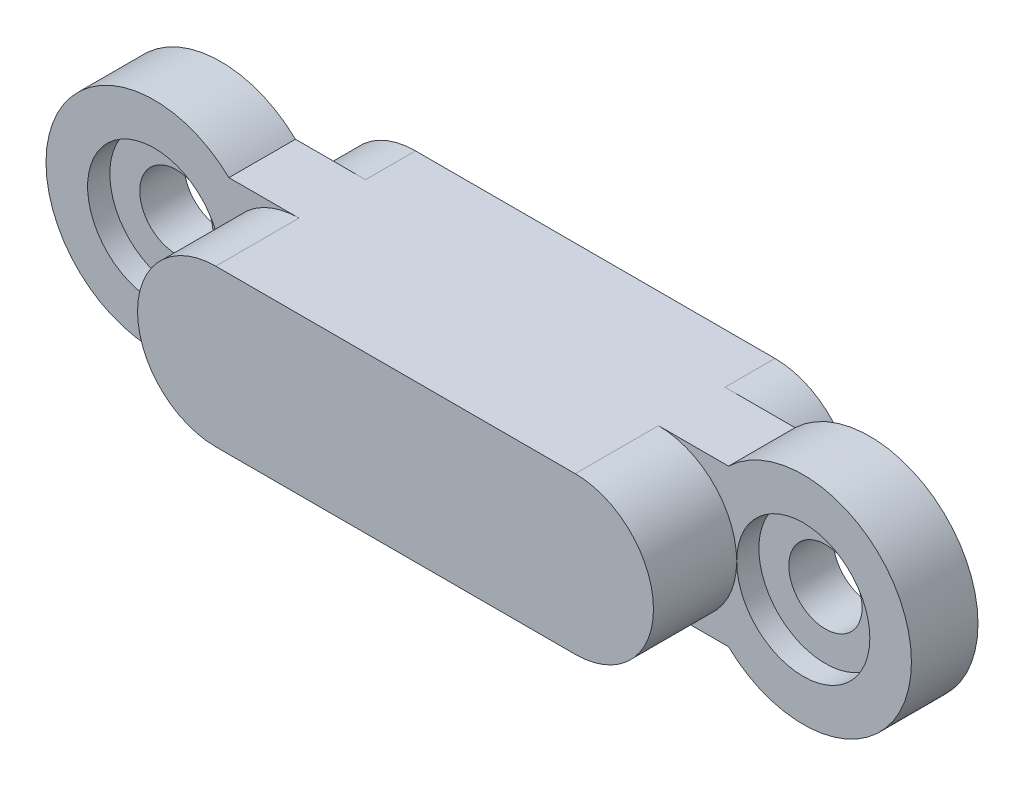
ISO-10303-21;
HEADER;
FILE_DESCRIPTION(('STEP AP214'),'2;1');
FILE_NAME('part.step','',(''),(''),'','','');
FILE_SCHEMA(('AUTOMOTIVE_DESIGN { 1 0 10303 214 1 1 1 1 }'));
ENDSEC;
DATA;
#1=APPLICATION_CONTEXT('core data for automotive mechanical design processes');
#2=APPLICATION_PROTOCOL_DEFINITION('international standard','automotive_design',2000,#1);
#3=PRODUCT_CONTEXT('',#1,'mechanical');
#4=PRODUCT('Part','Part','',(#3));
#5=PRODUCT_RELATED_PRODUCT_CATEGORY('part','',(#4));
#6=PRODUCT_DEFINITION_FORMATION('','',#4);
#7=PRODUCT_DEFINITION_CONTEXT('part definition',#1,'design');
#8=PRODUCT_DEFINITION('design','',#6,#7);
#9=PRODUCT_DEFINITION_SHAPE('','',#8);
#10=(LENGTH_UNIT() NAMED_UNIT(*) SI_UNIT(.MILLI.,.METRE.));
#11=(NAMED_UNIT(*) PLANE_ANGLE_UNIT() SI_UNIT($,.RADIAN.));
#12=(NAMED_UNIT(*) SI_UNIT($,.STERADIAN.) SOLID_ANGLE_UNIT());
#13=UNCERTAINTY_MEASURE_WITH_UNIT(LENGTH_MEASURE(1.E-05),#10,'distance_accuracy_value','');
#14=(GEOMETRIC_REPRESENTATION_CONTEXT(3) GLOBAL_UNCERTAINTY_ASSIGNED_CONTEXT((#13)) GLOBAL_UNIT_ASSIGNED_CONTEXT((#10,
#11,#12)) REPRESENTATION_CONTEXT('',''));
#15=CARTESIAN_POINT('',(0.,0.,0.));
#16=DIRECTION('',(0.,0.,1.));
#17=DIRECTION('',(1.,0.,0.));
#18=AXIS2_PLACEMENT_3D('',#15,#16,#17);
#19=CARTESIAN_POINT('',(0.,0.,-0.1));
#20=DIRECTION('',(0.,0.,-1.));
#21=DIRECTION('',(-1.,0.,0.));
#22=AXIS2_PLACEMENT_3D('',#19,#20,#21);
#23=PLANE('',#22);
#24=CARTESIAN_POINT('',(10.8,-2.35,-0.1));
#25=DIRECTION('',(0.,0.,-1.));
#26=DIRECTION('',(-1.,0.,0.));
#27=AXIS2_PLACEMENT_3D('',#24,#25,#26);
#28=CIRCLE('',#27,2.35);
#29=CARTESIAN_POINT('',(10.8,0.,-0.1));
#30=VERTEX_POINT('',#29);
#31=CARTESIAN_POINT('',(10.8,-4.7,-0.1));
#32=VERTEX_POINT('',#31);
#33=EDGE_CURVE('E86',#30,#32,#28,.T.);
#34=ORIENTED_EDGE('',*,*,#33,.F.);
#35=DIRECTION('',(-1.,0.,0.));
#36=VECTOR('',#35,1.);
#37=CARTESIAN_POINT('',(0.,0.,-0.1));
#38=LINE('',#37,#36);
#39=CARTESIAN_POINT('',(12.9050055679356,0.,-0.1));
#40=VERTEX_POINT('',#39);
#41=EDGE_CURVE('E222',#40,#30,#38,.T.);
#42=ORIENTED_EDGE('',*,*,#41,.F.);
#43=CARTESIAN_POINT('',(15.15,-2.35,-0.1));
#44=DIRECTION('',(0.,0.,-1.));
#45=DIRECTION('',(-1.,0.,0.));
#46=AXIS2_PLACEMENT_3D('',#43,#44,#45);
#47=CIRCLE('',#46,3.25);
#48=CARTESIAN_POINT('',(12.9050055679356,-4.7,-0.1));
#49=VERTEX_POINT('',#48);
#50=EDGE_CURVE('E224',#40,#49,#47,.T.);
#51=ORIENTED_EDGE('',*,*,#50,.T.);
#52=DIRECTION('',(-1.,0.,0.));
#53=VECTOR('',#52,1.);
#54=CARTESIAN_POINT('',(0.,-4.7,-0.1));
#55=LINE('',#54,#53);
#56=EDGE_CURVE('E215',#49,#32,#55,.T.);
#57=ORIENTED_EDGE('',*,*,#56,.T.);
#58=EDGE_LOOP('',(#34,#42,#51,#57));
#59=FACE_BOUND('',#58,.T.);
#60=CARTESIAN_POINT('',(15.15,-2.35,-0.1));
#61=DIRECTION('',(0.,0.,-1.));
#62=DIRECTION('',(-1.,0.,0.));
#63=AXIS2_PLACEMENT_3D('',#60,#61,#62);
#64=CIRCLE('',#63,1.1);
#65=CARTESIAN_POINT('',(14.05,-2.35,-0.1));
#66=VERTEX_POINT('',#65);
#67=EDGE_CURVE('E229',#66,#66,#64,.T.);
#68=ORIENTED_EDGE('',*,*,#67,.F.);
#69=EDGE_LOOP('',(#68));
#70=FACE_BOUND('',#69,.T.);
#71=ADVANCED_FACE('F71',(#59,#70),#23,.T.);
#72=CARTESIAN_POINT('',(-4.35,-2.34999999999999,-0.1));
#73=DIRECTION('',(0.,0.,1.));
#74=DIRECTION('',(1.,0.,0.));
#75=AXIS2_PLACEMENT_3D('',#72,#73,#74);
#76=CYLINDRICAL_SURFACE('',#75,1.1);
#77=CARTESIAN_POINT('',(-4.35,-2.34999999999999,-0.1));
#78=DIRECTION('',(0.,0.,-1.));
#79=DIRECTION('',(-1.,0.,0.));
#80=AXIS2_PLACEMENT_3D('',#77,#78,#79);
#81=CIRCLE('',#80,1.1);
#82=CARTESIAN_POINT('',(-5.45,-2.34999999999999,-0.1));
#83=VERTEX_POINT('',#82);
#84=EDGE_CURVE('E226',#83,#83,#81,.T.);
#85=ORIENTED_EDGE('',*,*,#84,.T.);
#86=EDGE_LOOP('',(#85));
#87=FACE_BOUND('',#86,.T.);
#88=CARTESIAN_POINT('',(-4.35,-2.34999999999999,1.23333333333333));
#89=DIRECTION('',(0.,0.,1.));
#90=DIRECTION('',(1.,0.,0.));
#91=AXIS2_PLACEMENT_3D('',#88,#89,#90);
#92=CIRCLE('',#91,1.1);
#93=CARTESIAN_POINT('',(-3.25,-2.34999999999999,1.23333333333333));
#94=VERTEX_POINT('',#93);
#95=EDGE_CURVE('E285',#94,#94,#92,.T.);
#96=ORIENTED_EDGE('',*,*,#95,.T.);
#97=EDGE_LOOP('',(#96));
#98=FACE_BOUND('',#97,.T.);
#99=ADVANCED_FACE('F321',(#87,#98),#76,.F.);
#100=CARTESIAN_POINT('',(15.15,-2.35,-0.1));
#101=DIRECTION('',(0.,0.,1.));
#102=DIRECTION('',(1.,0.,0.));
#103=AXIS2_PLACEMENT_3D('',#100,#101,#102);
#104=CYLINDRICAL_SURFACE('',#103,1.1);
#105=ORIENTED_EDGE('',*,*,#67,.T.);
#106=EDGE_LOOP('',(#105));
#107=FACE_BOUND('',#106,.T.);
#108=CARTESIAN_POINT('',(15.15,-2.35,1.23333333333333));
#109=DIRECTION('',(0.,0.,1.));
#110=DIRECTION('',(1.,0.,0.));
#111=AXIS2_PLACEMENT_3D('',#108,#109,#110);
#112=CIRCLE('',#111,1.1);
#113=CARTESIAN_POINT('',(16.25,-2.35,1.23333333333333));
#114=VERTEX_POINT('',#113);
#115=EDGE_CURVE('E208',#114,#114,#112,.T.);
#116=ORIENTED_EDGE('',*,*,#115,.T.);
#117=EDGE_LOOP('',(#116));
#118=FACE_BOUND('',#117,.T.);
#119=ADVANCED_FACE('F326',(#107,#118),#104,.F.);
#120=CARTESIAN_POINT('',(0.,-2.35,4.4));
#121=DIRECTION('',(0.,0.,-1.));
#122=DIRECTION('',(-1.,0.,0.));
#123=AXIS2_PLACEMENT_3D('',#120,#121,#122);
#124=CYLINDRICAL_SURFACE('',#123,2.35);
#125=CARTESIAN_POINT('',(0.,-2.35,1.9));
#126=DIRECTION('',(0.,0.,1.));
#127=DIRECTION('',(1.,0.,0.));
#128=AXIS2_PLACEMENT_3D('',#125,#126,#127);
#129=CIRCLE('',#128,2.35);
#130=CARTESIAN_POINT('',(0.,0.,1.9));
#131=VERTEX_POINT('',#130);
#132=CARTESIAN_POINT('',(-2.35,-2.35,1.9));
#133=VERTEX_POINT('',#132);
#134=EDGE_CURVE('E269',#131,#133,#129,.T.);
#135=ORIENTED_EDGE('',*,*,#134,.T.);
#136=CARTESIAN_POINT('',(0.,-4.7,1.9));
#137=VERTEX_POINT('',#136);
#138=EDGE_CURVE('E256',#133,#137,#129,.T.);
#139=ORIENTED_EDGE('',*,*,#138,.T.);
#140=DIRECTION('',(0.,0.,-1.));
#141=VECTOR('',#140,1.);
#142=CARTESIAN_POINT('',(0.,-4.7,4.4));
#143=LINE('',#142,#141);
#144=CARTESIAN_POINT('',(0.,-4.7,4.4));
#145=VERTEX_POINT('',#144);
#146=EDGE_CURVE('E79',#145,#137,#143,.T.);
#147=ORIENTED_EDGE('',*,*,#146,.F.);
#148=CARTESIAN_POINT('',(0.,-2.35,4.4));
#149=DIRECTION('',(0.,0.,1.));
#150=DIRECTION('',(1.,0.,0.));
#151=AXIS2_PLACEMENT_3D('',#148,#149,#150);
#152=CIRCLE('',#151,2.35);
#153=CARTESIAN_POINT('',(0.,0.,4.4));
#154=VERTEX_POINT('',#153);
#155=EDGE_CURVE('E257',#154,#145,#152,.T.);
#156=ORIENTED_EDGE('',*,*,#155,.F.);
#157=DIRECTION('',(0.,0.,-1.));
#158=VECTOR('',#157,1.);
#159=CARTESIAN_POINT('',(0.,0.,4.4));
#160=LINE('',#159,#158);
#161=EDGE_CURVE('E268',#154,#131,#160,.T.);
#162=ORIENTED_EDGE('',*,*,#161,.T.);
#163=EDGE_LOOP('',(#135,#139,#147,#156,#162));
#164=FACE_BOUND('',#163,.T.);
#165=ADVANCED_FACE('F73',(#164),#124,.T.);
#166=CARTESIAN_POINT('',(0.,-4.7,4.4));
#167=DIRECTION('',(0.,1.,0.));
#168=DIRECTION('',(0.,0.,1.));
#169=AXIS2_PLACEMENT_3D('',#166,#167,#168);
#170=PLANE('',#169);
#171=ORIENTED_EDGE('',*,*,#146,.T.);
#172=DIRECTION('',(-1.,0.,0.));
#173=VECTOR('',#172,1.);
#174=CARTESIAN_POINT('',(0.,-4.7,1.9));
#175=LINE('',#174,#173);
#176=CARTESIAN_POINT('',(-2.10500556793564,-4.7,1.9));
#177=VERTEX_POINT('',#176);
#178=EDGE_CURVE('E237',#137,#177,#175,.T.);
#179=ORIENTED_EDGE('',*,*,#178,.T.);
#180=DIRECTION('',(0.,0.,1.));
#181=VECTOR('',#180,1.);
#182=CARTESIAN_POINT('',(-2.10500556793564,-4.7,-0.1));
#183=LINE('',#182,#181);
#184=CARTESIAN_POINT('',(-2.10500556793564,-4.7,-0.1));
#185=VERTEX_POINT('',#184);
#186=EDGE_CURVE('E253',#185,#177,#183,.T.);
#187=ORIENTED_EDGE('',*,*,#186,.F.);
#188=CARTESIAN_POINT('',(0.,-4.7,-0.1));
#189=VERTEX_POINT('',#188);
#190=EDGE_CURVE('E218',#189,#185,#55,.T.);
#191=ORIENTED_EDGE('',*,*,#190,.F.);
#192=DIRECTION('',(0.,0.,1.));
#193=VECTOR('',#192,1.);
#194=CARTESIAN_POINT('',(0.,-4.7,-1.6));
#195=LINE('',#194,#193);
#196=CARTESIAN_POINT('',(0.,-4.7,-1.6));
#197=VERTEX_POINT('',#196);
#198=EDGE_CURVE('E192',#197,#189,#195,.T.);
#199=ORIENTED_EDGE('',*,*,#198,.F.);
#200=DIRECTION('',(-1.,0.,0.));
#201=VECTOR('',#200,1.);
#202=CARTESIAN_POINT('',(10.8,-4.7,-1.6));
#203=LINE('',#202,#201);
#204=CARTESIAN_POINT('',(10.8,-4.7,-1.6));
#205=VERTEX_POINT('',#204);
#206=EDGE_CURVE('E184',#205,#197,#203,.T.);
#207=ORIENTED_EDGE('',*,*,#206,.F.);
#208=DIRECTION('',(0.,0.,1.));
#209=VECTOR('',#208,1.);
#210=CARTESIAN_POINT('',(10.8,-4.7,-1.6));
#211=LINE('',#210,#209);
#212=EDGE_CURVE('E199',#205,#32,#211,.T.);
#213=ORIENTED_EDGE('',*,*,#212,.T.);
#214=ORIENTED_EDGE('',*,*,#56,.F.);
#215=DIRECTION('',(0.,0.,1.));
#216=VECTOR('',#215,1.);
#217=CARTESIAN_POINT('',(12.9050055679356,-4.7,-0.1));
#218=LINE('',#217,#216);
#219=CARTESIAN_POINT('',(12.9050055679356,-4.7,1.9));
#220=VERTEX_POINT('',#219);
#221=EDGE_CURVE('E232',#49,#220,#218,.T.);
#222=ORIENTED_EDGE('',*,*,#221,.T.);
#223=CARTESIAN_POINT('',(10.8,-4.7,1.9));
#224=VERTEX_POINT('',#223);
#225=EDGE_CURVE('E233',#220,#224,#175,.T.);
#226=ORIENTED_EDGE('',*,*,#225,.T.);
#227=DIRECTION('',(0.,0.,-1.));
#228=VECTOR('',#227,1.);
#229=CARTESIAN_POINT('',(10.8,-4.7,4.4));
#230=LINE('',#229,#228);
#231=CARTESIAN_POINT('',(10.8,-4.7,4.4));
#232=VERTEX_POINT('',#231);
#233=EDGE_CURVE('E279',#232,#224,#230,.T.);
#234=ORIENTED_EDGE('',*,*,#233,.F.);
#235=DIRECTION('',(1.,0.,0.));
#236=VECTOR('',#235,1.);
#237=CARTESIAN_POINT('',(0.,-4.7,4.4));
#238=LINE('',#237,#236);
#239=EDGE_CURVE('E260',#145,#232,#238,.T.);
#240=ORIENTED_EDGE('',*,*,#239,.F.);
#241=EDGE_LOOP('',(#171,#179,#187,#191,#199,#207,#213,#214,#222,#226,#234,#240));
#242=FACE_BOUND('',#241,.T.);
#243=ADVANCED_FACE('F293',(#242),#170,.F.);
#244=CARTESIAN_POINT('',(10.8,-2.35,4.4));
#245=DIRECTION('',(0.,0.,-1.));
#246=DIRECTION('',(-1.,0.,0.));
#247=AXIS2_PLACEMENT_3D('',#244,#245,#246);
#248=CYLINDRICAL_SURFACE('',#247,2.35);
#249=CARTESIAN_POINT('',(10.8,-2.35,1.9));
#250=DIRECTION('',(0.,0.,1.));
#251=DIRECTION('',(1.,0.,0.));
#252=AXIS2_PLACEMENT_3D('',#249,#250,#251);
#253=CIRCLE('',#252,2.35);
#254=CARTESIAN_POINT('',(13.15,-2.35,1.9));
#255=VERTEX_POINT('',#254);
#256=EDGE_CURVE('E261',#224,#255,#253,.T.);
#257=ORIENTED_EDGE('',*,*,#256,.T.);
#258=CARTESIAN_POINT('',(10.8,0.,1.9));
#259=VERTEX_POINT('',#258);
#260=EDGE_CURVE('E272',#255,#259,#253,.T.);
#261=ORIENTED_EDGE('',*,*,#260,.T.);
#262=DIRECTION('',(0.,0.,-1.));
#263=VECTOR('',#262,1.);
#264=CARTESIAN_POINT('',(10.8,0.,4.4));
#265=LINE('',#264,#263);
#266=CARTESIAN_POINT('',(10.8,0.,4.4));
#267=VERTEX_POINT('',#266);
#268=EDGE_CURVE('E277',#267,#259,#265,.T.);
#269=ORIENTED_EDGE('',*,*,#268,.F.);
#270=CARTESIAN_POINT('',(10.8,-2.35,4.4));
#271=DIRECTION('',(0.,0.,1.));
#272=DIRECTION('',(1.,0.,0.));
#273=AXIS2_PLACEMENT_3D('',#270,#271,#272);
#274=CIRCLE('',#273,2.35);
#275=EDGE_CURVE('E263',#232,#267,#274,.T.);
#276=ORIENTED_EDGE('',*,*,#275,.F.);
#277=ORIENTED_EDGE('',*,*,#233,.T.);
#278=EDGE_LOOP('',(#257,#261,#269,#276,#277));
#279=FACE_BOUND('',#278,.T.);
#280=ADVANCED_FACE('F355',(#279),#248,.T.);
#281=CARTESIAN_POINT('',(0.,0.,4.4));
#282=DIRECTION('',(0.,1.,0.));
#283=DIRECTION('',(0.,0.,1.));
#284=AXIS2_PLACEMENT_3D('',#281,#282,#283);
#285=PLANE('',#284);
#286=ORIENTED_EDGE('',*,*,#268,.T.);
#287=DIRECTION('',(-1.,0.,0.));
#288=VECTOR('',#287,1.);
#289=CARTESIAN_POINT('',(0.,0.,1.9));
#290=LINE('',#289,#288);
#291=CARTESIAN_POINT('',(12.9050055679356,0.,1.9));
#292=VERTEX_POINT('',#291);
#293=EDGE_CURVE('E241',#292,#259,#290,.T.);
#294=ORIENTED_EDGE('',*,*,#293,.F.);
#295=DIRECTION('',(0.,0.,1.));
#296=VECTOR('',#295,1.);
#297=CARTESIAN_POINT('',(12.9050055679356,0.,-0.1));
#298=LINE('',#297,#296);
#299=EDGE_CURVE('E248',#40,#292,#298,.T.);
#300=ORIENTED_EDGE('',*,*,#299,.F.);
#301=ORIENTED_EDGE('',*,*,#41,.T.);
#302=DIRECTION('',(0.,0.,1.));
#303=VECTOR('',#302,1.);
#304=CARTESIAN_POINT('',(10.8,0.,-1.6));
#305=LINE('',#304,#303);
#306=CARTESIAN_POINT('',(10.8,0.,-1.6));
#307=VERTEX_POINT('',#306);
#308=EDGE_CURVE('E176',#307,#30,#305,.T.);
#309=ORIENTED_EDGE('',*,*,#308,.F.);
#310=DIRECTION('',(-1.,0.,0.));
#311=VECTOR('',#310,1.);
#312=CARTESIAN_POINT('',(10.8,0.,-1.6));
#313=LINE('',#312,#311);
#314=CARTESIAN_POINT('',(0.,0.,-1.6));
#315=VERTEX_POINT('',#314);
#316=EDGE_CURVE('E182',#307,#315,#313,.T.);
#317=ORIENTED_EDGE('',*,*,#316,.T.);
#318=DIRECTION('',(0.,0.,1.));
#319=VECTOR('',#318,1.);
#320=CARTESIAN_POINT('',(0.,0.,-1.6));
#321=LINE('',#320,#319);
#322=CARTESIAN_POINT('',(0.,0.,-0.1));
#323=VERTEX_POINT('',#322);
#324=EDGE_CURVE('E167',#315,#323,#321,.T.);
#325=ORIENTED_EDGE('',*,*,#324,.T.);
#326=CARTESIAN_POINT('',(-2.10500556793563,0.,-0.1));
#327=VERTEX_POINT('',#326);
#328=EDGE_CURVE('E221',#323,#327,#38,.T.);
#329=ORIENTED_EDGE('',*,*,#328,.T.);
#330=DIRECTION('',(0.,0.,1.));
#331=VECTOR('',#330,1.);
#332=CARTESIAN_POINT('',(-2.10500556793563,0.,-0.1));
#333=LINE('',#332,#331);
#334=CARTESIAN_POINT('',(-2.10500556793563,0.,1.9));
#335=VERTEX_POINT('',#334);
#336=EDGE_CURVE('E250',#327,#335,#333,.T.);
#337=ORIENTED_EDGE('',*,*,#336,.T.);
#338=EDGE_CURVE('E240',#131,#335,#290,.T.);
#339=ORIENTED_EDGE('',*,*,#338,.F.);
#340=ORIENTED_EDGE('',*,*,#161,.F.);
#341=DIRECTION('',(1.,0.,0.));
#342=VECTOR('',#341,1.);
#343=CARTESIAN_POINT('',(0.,0.,4.4));
#344=LINE('',#343,#342);
#345=EDGE_CURVE('E265',#154,#267,#344,.T.);
#346=ORIENTED_EDGE('',*,*,#345,.T.);
#347=EDGE_LOOP('',(#286,#294,#300,#301,#309,#317,#325,#329,#337,#339,#340,#346));
#348=FACE_BOUND('',#347,.T.);
#349=ADVANCED_FACE('F187',(#348),#285,.T.);
#350=CARTESIAN_POINT('',(0.,0.,4.4));
#351=DIRECTION('',(0.,0.,1.));
#352=DIRECTION('',(1.,0.,0.));
#353=AXIS2_PLACEMENT_3D('',#350,#351,#352);
#354=PLANE('',#353);
#355=ORIENTED_EDGE('',*,*,#155,.T.);
#356=ORIENTED_EDGE('',*,*,#239,.T.);
#357=ORIENTED_EDGE('',*,*,#275,.T.);
#358=ORIENTED_EDGE('',*,*,#345,.F.);
#359=EDGE_LOOP('',(#355,#356,#357,#358));
#360=FACE_BOUND('',#359,.T.);
#361=ADVANCED_FACE('F349',(#360),#354,.T.);
#362=CARTESIAN_POINT('',(0.,0.,1.9));
#363=DIRECTION('',(0.,0.,-1.));
#364=DIRECTION('',(-1.,0.,0.));
#365=AXIS2_PLACEMENT_3D('',#362,#363,#364);
#366=PLANE('',#365);
#367=ORIENTED_EDGE('',*,*,#138,.F.);
#368=CARTESIAN_POINT('',(-4.35,-2.34999999999999,1.9));
#369=DIRECTION('',(0.,0.,1.));
#370=DIRECTION('',(1.,0.,0.));
#371=AXIS2_PLACEMENT_3D('',#368,#369,#370);
#372=CIRCLE('',#371,2.);
#373=EDGE_CURVE('E211',#133,#133,#372,.T.);
#374=ORIENTED_EDGE('',*,*,#373,.F.);
#375=ORIENTED_EDGE('',*,*,#134,.F.);
#376=ORIENTED_EDGE('',*,*,#338,.T.);
#377=CARTESIAN_POINT('',(-4.35,-2.34999999999999,1.9));
#378=DIRECTION('',(0.,0.,-1.));
#379=DIRECTION('',(-1.,0.,0.));
#380=AXIS2_PLACEMENT_3D('',#377,#378,#379);
#381=CIRCLE('',#380,3.25);
#382=EDGE_CURVE('E236',#177,#335,#381,.T.);
#383=ORIENTED_EDGE('',*,*,#382,.F.);
#384=ORIENTED_EDGE('',*,*,#178,.F.);
#385=EDGE_LOOP('',(#367,#374,#375,#376,#383,#384));
#386=FACE_BOUND('',#385,.T.);
#387=ADVANCED_FACE('F297',(#386),#366,.F.);
#388=CARTESIAN_POINT('',(-4.35,-2.34999999999999,-0.1));
#389=DIRECTION('',(0.,0.,1.));
#390=DIRECTION('',(1.,0.,0.));
#391=AXIS2_PLACEMENT_3D('',#388,#389,#390);
#392=CYLINDRICAL_SURFACE('',#391,3.25);
#393=ORIENTED_EDGE('',*,*,#382,.T.);
#394=ORIENTED_EDGE('',*,*,#336,.F.);
#395=CARTESIAN_POINT('',(-4.35,-2.34999999999999,-0.1));
#396=DIRECTION('',(0.,0.,-1.));
#397=DIRECTION('',(-1.,0.,0.));
#398=AXIS2_PLACEMENT_3D('',#395,#396,#397);
#399=CIRCLE('',#398,3.25);
#400=EDGE_CURVE('E217',#185,#327,#399,.T.);
#401=ORIENTED_EDGE('',*,*,#400,.F.);
#402=ORIENTED_EDGE('',*,*,#186,.T.);
#403=EDGE_LOOP('',(#393,#394,#401,#402));
#404=FACE_BOUND('',#403,.T.);
#405=ADVANCED_FACE('F302',(#404),#392,.T.);
#406=CARTESIAN_POINT('',(15.15,-2.35,-0.1));
#407=DIRECTION('',(0.,0.,1.));
#408=DIRECTION('',(1.,0.,0.));
#409=AXIS2_PLACEMENT_3D('',#406,#407,#408);
#410=CYLINDRICAL_SURFACE('',#409,3.25);
#411=CARTESIAN_POINT('',(15.15,-2.35,1.9));
#412=DIRECTION('',(0.,0.,-1.));
#413=DIRECTION('',(-1.,0.,0.));
#414=AXIS2_PLACEMENT_3D('',#411,#412,#413);
#415=CIRCLE('',#414,3.25);
#416=EDGE_CURVE('E244',#292,#220,#415,.T.);
#417=ORIENTED_EDGE('',*,*,#416,.T.);
#418=ORIENTED_EDGE('',*,*,#221,.F.);
#419=ORIENTED_EDGE('',*,*,#50,.F.);
#420=ORIENTED_EDGE('',*,*,#299,.T.);
#421=EDGE_LOOP('',(#417,#418,#419,#420));
#422=FACE_BOUND('',#421,.T.);
#423=ADVANCED_FACE('F334',(#422),#410,.T.);
#424=CARTESIAN_POINT('',(0.,-2.35,-0.1));
#425=DIRECTION('',(0.,0.,-1.));
#426=DIRECTION('',(-1.,0.,0.));
#427=AXIS2_PLACEMENT_3D('',#424,#425,#426);
#428=CIRCLE('',#427,2.35);
#429=EDGE_CURVE('E94',#189,#323,#428,.T.);
#430=ORIENTED_EDGE('',*,*,#429,.F.);
#431=ORIENTED_EDGE('',*,*,#190,.T.);
#432=ORIENTED_EDGE('',*,*,#400,.T.);
#433=ORIENTED_EDGE('',*,*,#328,.F.);
#434=EDGE_LOOP('',(#430,#431,#432,#433));
#435=FACE_BOUND('',#434,.T.);
#436=ORIENTED_EDGE('',*,*,#84,.F.);
#437=EDGE_LOOP('',(#436));
#438=FACE_BOUND('',#437,.T.);
#439=ADVANCED_FACE('F303',(#435,#438),#23,.T.);
#440=ORIENTED_EDGE('',*,*,#260,.F.);
#441=CARTESIAN_POINT('',(15.15,-2.35,1.9));
#442=DIRECTION('',(0.,0.,1.));
#443=DIRECTION('',(1.,0.,0.));
#444=AXIS2_PLACEMENT_3D('',#441,#442,#443);
#445=CIRCLE('',#444,2.);
#446=EDGE_CURVE('E209',#255,#255,#445,.T.);
#447=ORIENTED_EDGE('',*,*,#446,.F.);
#448=ORIENTED_EDGE('',*,*,#256,.F.);
#449=ORIENTED_EDGE('',*,*,#225,.F.);
#450=ORIENTED_EDGE('',*,*,#416,.F.);
#451=ORIENTED_EDGE('',*,*,#293,.T.);
#452=EDGE_LOOP('',(#440,#447,#448,#449,#450,#451));
#453=FACE_BOUND('',#452,.T.);
#454=ADVANCED_FACE('F333',(#453),#366,.F.);
#455=CARTESIAN_POINT('',(15.15,-2.35,1.23333333333333));
#456=DIRECTION('',(0.,0.,1.));
#457=DIRECTION('',(1.,0.,0.));
#458=AXIS2_PLACEMENT_3D('',#455,#456,#457);
#459=CYLINDRICAL_SURFACE('',#458,2.);
#460=CARTESIAN_POINT('',(15.15,-2.35,1.23333333333333));
#461=DIRECTION('',(0.,0.,1.));
#462=DIRECTION('',(1.,0.,0.));
#463=AXIS2_PLACEMENT_3D('',#460,#461,#462);
#464=CIRCLE('',#463,2.);
#465=CARTESIAN_POINT('',(17.15,-2.35,1.23333333333333));
#466=VERTEX_POINT('',#465);
#467=EDGE_CURVE('E205',#466,#466,#464,.T.);
#468=ORIENTED_EDGE('',*,*,#467,.F.);
#469=EDGE_LOOP('',(#468));
#470=FACE_BOUND('',#469,.T.);
#471=ORIENTED_EDGE('',*,*,#446,.T.);
#472=EDGE_LOOP('',(#471));
#473=FACE_BOUND('',#472,.T.);
#474=ADVANCED_FACE('F339',(#470,#473),#459,.F.);
#475=CARTESIAN_POINT('',(15.15,-2.35,1.23333333333333));
#476=DIRECTION('',(0.,0.,1.));
#477=DIRECTION('',(1.,0.,0.));
#478=AXIS2_PLACEMENT_3D('',#475,#476,#477);
#479=PLANE('',#478);
#480=ORIENTED_EDGE('',*,*,#115,.F.);
#481=EDGE_LOOP('',(#480));
#482=FACE_BOUND('',#481,.T.);
#483=ORIENTED_EDGE('',*,*,#467,.T.);
#484=EDGE_LOOP('',(#483));
#485=FACE_BOUND('',#484,.T.);
#486=ADVANCED_FACE('F382',(#482,#485),#479,.T.);
#487=CARTESIAN_POINT('',(-4.35,-2.34999999999999,1.23333333333333));
#488=DIRECTION('',(0.,0.,1.));
#489=DIRECTION('',(1.,0.,0.));
#490=AXIS2_PLACEMENT_3D('',#487,#488,#489);
#491=CYLINDRICAL_SURFACE('',#490,2.);
#492=CARTESIAN_POINT('',(-4.35,-2.34999999999999,1.23333333333333));
#493=DIRECTION('',(0.,0.,1.));
#494=DIRECTION('',(1.,0.,0.));
#495=AXIS2_PLACEMENT_3D('',#492,#493,#494);
#496=CIRCLE('',#495,2.);
#497=CARTESIAN_POINT('',(-2.35,-2.34999999999999,1.23333333333333));
#498=VERTEX_POINT('',#497);
#499=EDGE_CURVE('E175',#498,#498,#496,.T.);
#500=ORIENTED_EDGE('',*,*,#499,.F.);
#501=EDGE_LOOP('',(#500));
#502=FACE_BOUND('',#501,.T.);
#503=ORIENTED_EDGE('',*,*,#373,.T.);
#504=EDGE_LOOP('',(#503));
#505=FACE_BOUND('',#504,.T.);
#506=ADVANCED_FACE('F388',(#502,#505),#491,.F.);
#507=CARTESIAN_POINT('',(-4.35,-2.34999999999999,1.23333333333333));
#508=DIRECTION('',(0.,0.,1.));
#509=DIRECTION('',(1.,0.,0.));
#510=AXIS2_PLACEMENT_3D('',#507,#508,#509);
#511=PLANE('',#510);
#512=ORIENTED_EDGE('',*,*,#95,.F.);
#513=EDGE_LOOP('',(#512));
#514=FACE_BOUND('',#513,.T.);
#515=ORIENTED_EDGE('',*,*,#499,.T.);
#516=EDGE_LOOP('',(#515));
#517=FACE_BOUND('',#516,.T.);
#518=ADVANCED_FACE('F394',(#514,#517),#511,.T.);
#519=CARTESIAN_POINT('',(0.,0.,-1.6));
#520=DIRECTION('',(0.,0.,1.));
#521=DIRECTION('',(1.,0.,0.));
#522=AXIS2_PLACEMENT_3D('',#519,#520,#521);
#523=PLANE('',#522);
#524=CARTESIAN_POINT('',(5.4,-2.35,-1.6));
#525=DIRECTION('',(0.,0.,1.));
#526=DIRECTION('',(1.,0.,0.));
#527=AXIS2_PLACEMENT_3D('',#524,#525,#526);
#528=CIRCLE('',#527,0.500000000000001);
#529=CARTESIAN_POINT('',(5.9,-2.35,-1.6));
#530=VERTEX_POINT('',#529);
#531=EDGE_CURVE('E12',#530,#530,#528,.F.);
#532=ORIENTED_EDGE('',*,*,#531,.F.);
#533=EDGE_LOOP('',(#532));
#534=FACE_BOUND('',#533,.T.);
#535=ORIENTED_EDGE('',*,*,#316,.F.);
#536=CARTESIAN_POINT('',(10.8,-2.35,-1.6));
#537=DIRECTION('',(0.,0.,-1.));
#538=DIRECTION('',(-1.,0.,0.));
#539=AXIS2_PLACEMENT_3D('',#536,#537,#538);
#540=CIRCLE('',#539,2.35);
#541=EDGE_CURVE('E190',#307,#205,#540,.T.);
#542=ORIENTED_EDGE('',*,*,#541,.T.);
#543=ORIENTED_EDGE('',*,*,#206,.T.);
#544=CARTESIAN_POINT('',(0.,-2.35,-1.6));
#545=DIRECTION('',(0.,0.,-1.));
#546=DIRECTION('',(-1.,0.,0.));
#547=AXIS2_PLACEMENT_3D('',#544,#545,#546);
#548=CIRCLE('',#547,2.35);
#549=EDGE_CURVE('E171',#197,#315,#548,.T.);
#550=ORIENTED_EDGE('',*,*,#549,.T.);
#551=EDGE_LOOP('',(#535,#542,#543,#550));
#552=FACE_BOUND('',#551,.T.);
#553=ADVANCED_FACE('F180',(#534,#552),#523,.F.);
#554=CARTESIAN_POINT('',(0.,-2.35,-1.6));
#555=DIRECTION('',(0.,0.,1.));
#556=DIRECTION('',(1.,0.,0.));
#557=AXIS2_PLACEMENT_3D('',#554,#555,#556);
#558=CYLINDRICAL_SURFACE('',#557,2.35);
#559=ORIENTED_EDGE('',*,*,#429,.T.);
#560=ORIENTED_EDGE('',*,*,#324,.F.);
#561=ORIENTED_EDGE('',*,*,#549,.F.);
#562=ORIENTED_EDGE('',*,*,#198,.T.);
#563=EDGE_LOOP('',(#559,#560,#561,#562));
#564=FACE_BOUND('',#563,.T.);
#565=ADVANCED_FACE('F169',(#564),#558,.T.);
#566=CARTESIAN_POINT('',(10.8,-2.35,-1.6));
#567=DIRECTION('',(0.,0.,1.));
#568=DIRECTION('',(1.,0.,0.));
#569=AXIS2_PLACEMENT_3D('',#566,#567,#568);
#570=CYLINDRICAL_SURFACE('',#569,2.35);
#571=ORIENTED_EDGE('',*,*,#308,.T.);
#572=ORIENTED_EDGE('',*,*,#33,.T.);
#573=ORIENTED_EDGE('',*,*,#212,.F.);
#574=ORIENTED_EDGE('',*,*,#541,.F.);
#575=EDGE_LOOP('',(#571,#572,#573,#574));
#576=FACE_BOUND('',#575,.T.);
#577=ADVANCED_FACE('F307',(#576),#570,.T.);
#578=CARTESIAN_POINT('',(5.4,-2.35,-3.1));
#579=DIRECTION('',(0.,0.,1.));
#580=DIRECTION('',(1.,0.,0.));
#581=AXIS2_PLACEMENT_3D('',#578,#579,#580);
#582=CYLINDRICAL_SURFACE('',#581,0.500000000000001);
#583=CARTESIAN_POINT('',(5.4,-2.35,-3.1));
#584=DIRECTION('',(0.,0.,-1.));
#585=DIRECTION('',(-1.,0.,0.));
#586=AXIS2_PLACEMENT_3D('',#583,#584,#585);
#587=CIRCLE('',#586,0.500000000000001);
#588=CARTESIAN_POINT('',(4.9,-2.35,-3.1));
#589=VERTEX_POINT('',#588);
#590=EDGE_CURVE('E196',#589,#589,#587,.T.);
#591=ORIENTED_EDGE('',*,*,#590,.F.);
#592=EDGE_LOOP('',(#591));
#593=FACE_BOUND('',#592,.T.);
#594=ORIENTED_EDGE('',*,*,#531,.T.);
#595=EDGE_LOOP('',(#594));
#596=FACE_BOUND('',#595,.T.);
#597=ADVANCED_FACE('F309',(#593,#596),#582,.T.);
#598=CARTESIAN_POINT('',(5.4,-2.35,-3.1));
#599=DIRECTION('',(0.,0.,-1.));
#600=DIRECTION('',(-1.,0.,0.));
#601=AXIS2_PLACEMENT_3D('',#598,#599,#600);
#602=PLANE('',#601);
#603=ORIENTED_EDGE('',*,*,#590,.T.);
#604=EDGE_LOOP('',(#603));
#605=FACE_BOUND('',#604,.T.);
#606=ADVANCED_FACE('F315',(#605),#602,.T.);
#607=CLOSED_SHELL('',(#71,#99,#119,#165,#243,#280,#349,#361,#387,#405,#423,#439,#454,#474,#486,
#506,#518,#553,#565,#577,#597,#606));
#608=MANIFOLD_SOLID_BREP('B2',#607);
#609=ADVANCED_BREP_SHAPE_REPRESENTATION('',(#18,#608),#14);
#610=SHAPE_DEFINITION_REPRESENTATION(#9,#609);
ENDSEC;
END-ISO-10303-21;
